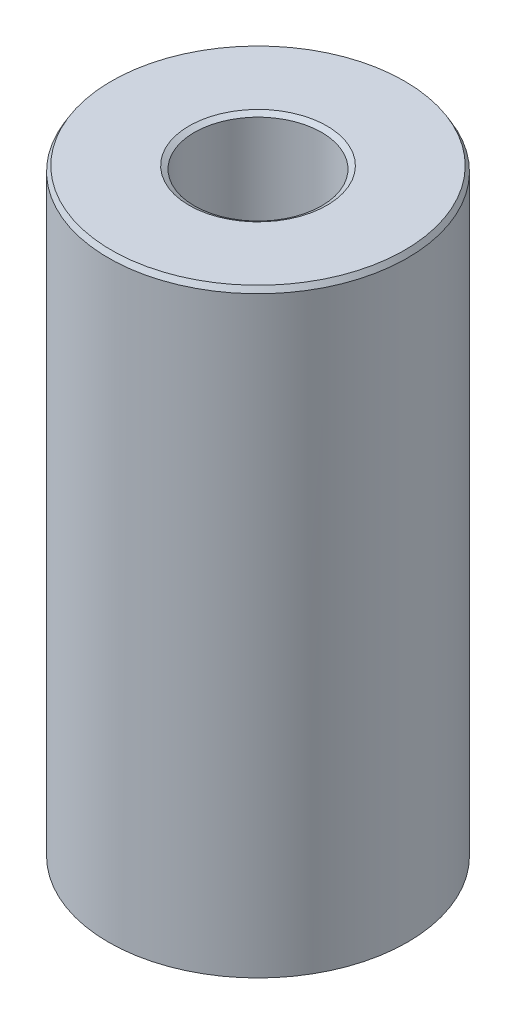
ISO-10303-21;
HEADER;
FILE_DESCRIPTION(('STEP AP214'),'2;1');
FILE_NAME('part.step','',(''),(''),'','','');
FILE_SCHEMA(('AUTOMOTIVE_DESIGN { 1 0 10303 214 1 1 1 1 }'));
ENDSEC;
DATA;
#1=APPLICATION_CONTEXT('core data for automotive mechanical design processes');
#2=APPLICATION_PROTOCOL_DEFINITION('international standard','automotive_design',2000,#1);
#3=PRODUCT_CONTEXT('',#1,'mechanical');
#4=PRODUCT('Part','Part','',(#3));
#5=PRODUCT_RELATED_PRODUCT_CATEGORY('part','',(#4));
#6=PRODUCT_DEFINITION_FORMATION('','',#4);
#7=PRODUCT_DEFINITION_CONTEXT('part definition',#1,'design');
#8=PRODUCT_DEFINITION('design','',#6,#7);
#9=PRODUCT_DEFINITION_SHAPE('','',#8);
#10=(LENGTH_UNIT() NAMED_UNIT(*) SI_UNIT(.MILLI.,.METRE.));
#11=(NAMED_UNIT(*) PLANE_ANGLE_UNIT() SI_UNIT($,.RADIAN.));
#12=(NAMED_UNIT(*) SI_UNIT($,.STERADIAN.) SOLID_ANGLE_UNIT());
#13=UNCERTAINTY_MEASURE_WITH_UNIT(LENGTH_MEASURE(1.E-05),#10,'distance_accuracy_value','');
#14=(GEOMETRIC_REPRESENTATION_CONTEXT(3) GLOBAL_UNCERTAINTY_ASSIGNED_CONTEXT((#13)) GLOBAL_UNIT_ASSIGNED_CONTEXT((#10,
#11,#12)) REPRESENTATION_CONTEXT('',''));
#15=CARTESIAN_POINT('',(0.,0.,0.));
#16=DIRECTION('',(0.,0.,1.));
#17=DIRECTION('',(1.,0.,0.));
#18=AXIS2_PLACEMENT_3D('',#15,#16,#17);
#19=CARTESIAN_POINT('',(0.,150.655996117848,0.));
#20=DIRECTION('',(0.,-1.,0.));
#21=DIRECTION('',(0.,0.,-1.));
#22=AXIS2_PLACEMENT_3D('',#19,#20,#21);
#23=CYLINDRICAL_SURFACE('',#22,37.5);
#24=CARTESIAN_POINT('',(0.,0.755875832907121,0.));
#25=DIRECTION('',(0.,1.,0.));
#26=DIRECTION('',(0.,0.,1.));
#27=AXIS2_PLACEMENT_3D('',#24,#25,#26);
#28=CIRCLE('',#27,37.5);
#29=CARTESIAN_POINT('',(0.,0.755875832907121,37.5));
#30=VERTEX_POINT('',#29);
#31=EDGE_CURVE('E10',#30,#30,#28,.T.);
#32=ORIENTED_EDGE('',*,*,#31,.T.);
#33=EDGE_LOOP('',(#32));
#34=FACE_BOUND('',#33,.T.);
#35=CARTESIAN_POINT('',(0.,149.346780771039,0.));
#36=DIRECTION('',(0.,1.,0.));
#37=DIRECTION('',(0.,0.,1.));
#38=AXIS2_PLACEMENT_3D('',#35,#36,#37);
#39=CIRCLE('',#38,37.5);
#40=CARTESIAN_POINT('',(0.,149.346780771039,-37.5));
#41=VERTEX_POINT('',#40);
#42=EDGE_CURVE('E50',#41,#41,#39,.F.);
#43=ORIENTED_EDGE('',*,*,#42,.T.);
#44=EDGE_LOOP('',(#43));
#45=FACE_BOUND('',#44,.T.);
#46=ADVANCED_FACE('F39',(#34,#45),#23,.T.);
#47=CARTESIAN_POINT('',(0.,150.655996117848,0.));
#48=DIRECTION('',(0.,1.,0.));
#49=DIRECTION('',(0.,0.,1.));
#50=AXIS2_PLACEMENT_3D('',#47,#48,#49);
#51=PLANE('',#50);
#52=CARTESIAN_POINT('',(0.,150.655996117848,0.));
#53=DIRECTION('',(0.,1.,0.));
#54=DIRECTION('',(0.,0.,1.));
#55=AXIS2_PLACEMENT_3D('',#52,#53,#54);
#56=CIRCLE('',#55,17.273251766127);
#57=CARTESIAN_POINT('',(0.,150.655996117848,17.273251766127));
#58=VERTEX_POINT('',#57);
#59=EDGE_CURVE('E58',#58,#58,#56,.F.);
#60=ORIENTED_EDGE('',*,*,#59,.T.);
#61=EDGE_LOOP('',(#60));
#62=FACE_BOUND('',#61,.T.);
#63=CARTESIAN_POINT('',(0.,150.655996117848,0.));
#64=DIRECTION('',(0.,1.,0.));
#65=DIRECTION('',(0.,0.,1.));
#66=AXIS2_PLACEMENT_3D('',#63,#64,#65);
#67=CIRCLE('',#66,36.7441241670929);
#68=CARTESIAN_POINT('',(0.,150.655996117848,-36.7441241670929));
#69=VERTEX_POINT('',#68);
#70=EDGE_CURVE('E61',#69,#69,#67,.T.);
#71=ORIENTED_EDGE('',*,*,#70,.T.);
#72=EDGE_LOOP('',(#71));
#73=FACE_BOUND('',#72,.T.);
#74=ADVANCED_FACE('F88',(#62,#73),#51,.T.);
#75=CARTESIAN_POINT('',(0.,0.,0.));
#76=DIRECTION('',(0.,1.,0.));
#77=DIRECTION('',(0.,0.,1.));
#78=AXIS2_PLACEMENT_3D('',#75,#76,#77);
#79=PLANE('',#78);
#80=CARTESIAN_POINT('',(0.,0.,0.));
#81=DIRECTION('',(0.,1.,0.));
#82=DIRECTION('',(0.,0.,1.));
#83=AXIS2_PLACEMENT_3D('',#80,#81,#82);
#84=CIRCLE('',#83,16.7199122522255);
#85=CARTESIAN_POINT('',(0.,0.,-16.7199122522255));
#86=VERTEX_POINT('',#85);
#87=EDGE_CURVE('E51',#86,#86,#84,.T.);
#88=ORIENTED_EDGE('',*,*,#87,.T.);
#89=EDGE_LOOP('',(#88));
#90=FACE_BOUND('',#89,.T.);
#91=CARTESIAN_POINT('',(0.,0.,0.));
#92=DIRECTION('',(0.,1.,0.));
#93=DIRECTION('',(0.,0.,1.));
#94=AXIS2_PLACEMENT_3D('',#91,#92,#93);
#95=CIRCLE('',#94,36.1907846531915);
#96=CARTESIAN_POINT('',(0.,0.,36.1907846531915));
#97=VERTEX_POINT('',#96);
#98=EDGE_CURVE('E54',#97,#97,#95,.F.);
#99=ORIENTED_EDGE('',*,*,#98,.T.);
#100=EDGE_LOOP('',(#99));
#101=FACE_BOUND('',#100,.T.);
#102=ADVANCED_FACE('F83',(#90,#101),#79,.F.);
#103=CARTESIAN_POINT('',(0.,150.655996117848,0.));
#104=DIRECTION('',(0.,-1.,0.));
#105=DIRECTION('',(0.,0.,-1.));
#106=AXIS2_PLACEMENT_3D('',#103,#104,#105);
#107=CYLINDRICAL_SURFACE('',#106,15.9640364193184);
#108=CARTESIAN_POINT('',(0.,149.900120284941,0.));
#109=DIRECTION('',(0.,1.,0.));
#110=DIRECTION('',(0.,0.,1.));
#111=AXIS2_PLACEMENT_3D('',#108,#109,#110);
#112=CIRCLE('',#111,15.9640364193184);
#113=CARTESIAN_POINT('',(0.,149.900120284941,15.9640364193184));
#114=VERTEX_POINT('',#113);
#115=EDGE_CURVE('E67',#114,#114,#112,.T.);
#116=ORIENTED_EDGE('',*,*,#115,.T.);
#117=EDGE_LOOP('',(#116));
#118=FACE_BOUND('',#117,.T.);
#119=CARTESIAN_POINT('',(0.,1.30921534680858,0.));
#120=DIRECTION('',(0.,1.,0.));
#121=DIRECTION('',(0.,0.,1.));
#122=AXIS2_PLACEMENT_3D('',#119,#120,#121);
#123=CIRCLE('',#122,15.9640364193184);
#124=CARTESIAN_POINT('',(0.,1.30921534680858,-15.9640364193184));
#125=VERTEX_POINT('',#124);
#126=EDGE_CURVE('E69',#125,#125,#123,.F.);
#127=ORIENTED_EDGE('',*,*,#126,.T.);
#128=EDGE_LOOP('',(#127));
#129=FACE_BOUND('',#128,.T.);
#130=ADVANCED_FACE('F71',(#118,#129),#107,.F.);
#131=CARTESIAN_POINT('',(0.,149.900120284941,0.));
#132=DIRECTION('',(0.,1.,0.));
#133=DIRECTION('',(0.,0.,1.));
#134=AXIS2_PLACEMENT_3D('',#131,#132,#133);
#135=CONICAL_SURFACE('',#134,15.9640364193184,1.04719755119659);
#136=ORIENTED_EDGE('',*,*,#59,.F.);
#137=EDGE_LOOP('',(#136));
#138=FACE_BOUND('',#137,.T.);
#139=ORIENTED_EDGE('',*,*,#115,.F.);
#140=EDGE_LOOP('',(#139));
#141=FACE_BOUND('',#140,.T.);
#142=ADVANCED_FACE('F77',(#138,#141),#135,.F.);
#143=CARTESIAN_POINT('',(0.,0.,0.));
#144=DIRECTION('',(0.,-1.,0.));
#145=DIRECTION('',(0.,0.,-1.));
#146=AXIS2_PLACEMENT_3D('',#143,#144,#145);
#147=CONICAL_SURFACE('',#146,16.7199122522255,0.523598775598301);
#148=CARTESIAN_POINT('',(0.,1.30921534680858,-15.9640364193184));
#149=CARTESIAN_POINT('',(0.,1.29557768694599,-15.9719101259112));
#150=CARTESIAN_POINT('',(0.,1.2819400270834,-15.979783832504));
#151=CARTESIAN_POINT('',(0.,1.25466470735823,-15.9955312456895));
#152=CARTESIAN_POINT('',(0.,1.24102704749564,-16.0034049522823));
#153=CARTESIAN_POINT('',(0.,1.21375172777046,-16.0191523654679));
#154=CARTESIAN_POINT('',(0.,1.20011406790787,-16.0270260720607));
#155=CARTESIAN_POINT('',(0.,1.17283874818269,-16.0427734852462));
#156=CARTESIAN_POINT('',(0.,1.1592010883201,-16.050647191839));
#157=CARTESIAN_POINT('',(0.,1.13192576859492,-16.0663946050246));
#158=CARTESIAN_POINT('',(0.,1.11828810873233,-16.0742683116173));
#159=CARTESIAN_POINT('',(0.,1.09101278900715,-16.0900157248029));
#160=CARTESIAN_POINT('',(0.,1.07737512914456,-16.0978894313957));
#161=CARTESIAN_POINT('',(0.,1.05009980941939,-16.1136368445813));
#162=CARTESIAN_POINT('',(0.,1.0364621495568,-16.121510551174));
#163=CARTESIAN_POINT('',(0.,1.00918682983162,-16.1372579643596));
#164=CARTESIAN_POINT('',(0.,0.995549169969027,-16.1451316709524));
#165=CARTESIAN_POINT('',(0.,0.968273850243848,-16.160879084138));
#166=CARTESIAN_POINT('',(0.,0.954636190381259,-16.1687527907307));
#167=CARTESIAN_POINT('',(0.,0.927360870656081,-16.1845002039163));
#168=CARTESIAN_POINT('',(0.,0.913723210793491,-16.1923739105091));
#169=CARTESIAN_POINT('',(0.,0.886447891068312,-16.2081213236947));
#170=CARTESIAN_POINT('',(0.,0.872810231205723,-16.2159950302874));
#171=CARTESIAN_POINT('',(0.,0.845534911480544,-16.231742443473));
#172=CARTESIAN_POINT('',(0.,0.831897251617954,-16.2396161500658));
#173=CARTESIAN_POINT('',(0.,0.804621931892776,-16.2553635632514));
#174=CARTESIAN_POINT('',(0.,0.790984272030187,-16.2632372698441));
#175=CARTESIAN_POINT('',(0.,0.763708952305008,-16.2789846830297));
#176=CARTESIAN_POINT('',(0.,0.750071292442418,-16.2868583896225));
#177=CARTESIAN_POINT('',(0.,0.722795972717239,-16.302605802808));
#178=CARTESIAN_POINT('',(0.,0.70915831285465,-16.3104795094008));
#179=CARTESIAN_POINT('',(0.,0.681882993129471,-16.3262269225864));
#180=CARTESIAN_POINT('',(0.,0.668245333266882,-16.3341006291792));
#181=CARTESIAN_POINT('',(0.,0.640970013541703,-16.3498480423647));
#182=CARTESIAN_POINT('',(0.,0.627332353679113,-16.3577217489575));
#183=CARTESIAN_POINT('',(0.,0.600057033953935,-16.3734691621431));
#184=CARTESIAN_POINT('',(0.,0.586419374091345,-16.3813428687359));
#185=CARTESIAN_POINT('',(0.,0.559144054366166,-16.3970902819214));
#186=CARTESIAN_POINT('',(0.,0.545506394503577,-16.4049639885142));
#187=CARTESIAN_POINT('',(0.,0.518231074778397,-16.4207114016998));
#188=CARTESIAN_POINT('',(0.,0.504593414915808,-16.4285851082926));
#189=CARTESIAN_POINT('',(0.,0.47731809519063,-16.4443325214781));
#190=CARTESIAN_POINT('',(0.,0.46368043532804,-16.4522062280709));
#191=CARTESIAN_POINT('',(0.,0.436405115602861,-16.4679536412565));
#192=CARTESIAN_POINT('',(0.,0.422767455740272,-16.4758273478493));
#193=CARTESIAN_POINT('',(0.,0.395492136015093,-16.4915747610348));
#194=CARTESIAN_POINT('',(0.,0.381854476152504,-16.4994484676276));
#195=CARTESIAN_POINT('',(0.,0.354579156427325,-16.5151958808132));
#196=CARTESIAN_POINT('',(0.,0.340941496564736,-16.523069587406));
#197=CARTESIAN_POINT('',(0.,0.313666176839557,-16.5388170005915));
#198=CARTESIAN_POINT('',(0.,0.300028516976967,-16.5466907071843));
#199=CARTESIAN_POINT('',(0.,0.272753197251788,-16.5624381203699));
#200=CARTESIAN_POINT('',(0.,0.259115537389199,-16.5703118269627));
#201=CARTESIAN_POINT('',(0.,0.23184021766402,-16.5860592401482));
#202=CARTESIAN_POINT('',(0.,0.218202557801431,-16.593932946741));
#203=CARTESIAN_POINT('',(0.,0.190927238076252,-16.6096803599266));
#204=CARTESIAN_POINT('',(0.,0.177289578213662,-16.6175540665194));
#205=CARTESIAN_POINT('',(0.,0.150014258488484,-16.6333014797049));
#206=CARTESIAN_POINT('',(0.,0.136376598625894,-16.6411751862977));
#207=CARTESIAN_POINT('',(0.,0.109101278900716,-16.6569225994833));
#208=CARTESIAN_POINT('',(0.,0.0954636190381258,-16.664796306076));
#209=CARTESIAN_POINT('',(0.,0.0681882993129468,-16.6805437192616));
#210=CARTESIAN_POINT('',(0.,0.0545506394503575,-16.6884174258544));
#211=CARTESIAN_POINT('',(0.,0.027275319725179,-16.70416483904));
#212=CARTESIAN_POINT('',(0.,0.0136376598625898,-16.7120385456327));
#213=CARTESIAN_POINT('',(0.,0.,-16.7199122522255));
#214=B_SPLINE_CURVE_WITH_KNOTS('',3,(#148,#149,#150,#151,#152,#153,#154,#155,#156,#157,#158,
#159,#160,#161,#162,#163,#164,#165,#166,#167,#168,#169,#170,#171,#172,#173,#174,#175,#176,#177,
#178,#179,#180,#181,#182,#183,#184,#185,#186,#187,#188,#189,#190,#191,#192,#193,#194,#195,#196,
#197,#198,#199,#200,#201,#202,#203,#204,#205,#206,#207,#208,#209,#210,#211,#212,#213),
.UNSPECIFIED.,.F.,.F.,(4,2,2,2,2,2,2,2,2,2,2,2,2,2,2,2,2,2,2,2,2,2,2,2,2,2,2,2,2,2,2,2,4),(0.,
0.0472422395566957,0.0944844791133914,0.141726718670085,0.188968958226781,0.236211197783477,
0.283453437340173,0.330695676896868,0.377937916453562,0.425180156010258,0.472422395566954,
0.519664635123649,0.566906874680345,0.614149114237041,0.661391353793735,0.708633593350431,
0.755875832907126,0.803118072463822,0.850360312020518,0.897602551577212,0.944844791133907,
0.992087030690603,1.0393292702473,1.08657150980399,1.13381374936069,1.18105598891738,
1.22829822847408,1.27554046803078,1.32278270758747,1.37002494714417,1.41726718670086,
1.46450942625756,1.51175166581425),.UNSPECIFIED.);
#215=EDGE_CURVE('BSEAM73',#125,#86,#214,.T.);
#216=ORIENTED_EDGE('',*,*,#126,.F.);
#217=ORIENTED_EDGE('',*,*,#87,.F.);
#218=ORIENTED_EDGE('',*,*,#215,.T.);
#219=ORIENTED_EDGE('',*,*,#215,.F.);
#220=EDGE_LOOP('',(#216,#218,#217,#219));
#221=FACE_BOUND('',#220,.T.);
#222=ADVANCED_FACE('F73',(#221),#147,.F.);
#223=CARTESIAN_POINT('',(0.,0.755875832907121,0.));
#224=DIRECTION('',(0.,1.,0.));
#225=DIRECTION('',(0.,0.,1.));
#226=AXIS2_PLACEMENT_3D('',#223,#224,#225);
#227=CONICAL_SURFACE('',#226,37.5,1.04719755119659);
#228=ORIENTED_EDGE('',*,*,#98,.F.);
#229=EDGE_LOOP('',(#228));
#230=FACE_BOUND('',#229,.T.);
#231=ORIENTED_EDGE('',*,*,#31,.F.);
#232=EDGE_LOOP('',(#231));
#233=FACE_BOUND('',#232,.T.);
#234=ADVANCED_FACE('F76',(#230,#233),#227,.T.);
#235=CARTESIAN_POINT('',(0.,150.655996117848,0.));
#236=DIRECTION('',(0.,-1.,0.));
#237=DIRECTION('',(0.,0.,-1.));
#238=AXIS2_PLACEMENT_3D('',#235,#236,#237);
#239=CONICAL_SURFACE('',#238,36.7441241670929,0.523598775598281);
#240=CARTESIAN_POINT('',(0.,149.346780771039,-37.5));
#241=CARTESIAN_POINT('',(0.,149.360418430902,-37.4921262934072));
#242=CARTESIAN_POINT('',(0.,149.374056090764,-37.4842525868144));
#243=CARTESIAN_POINT('',(0.,149.401331410489,-37.4685051736289));
#244=CARTESIAN_POINT('',(0.,149.414969070352,-37.4606314670361));
#245=CARTESIAN_POINT('',(0.,149.442244390077,-37.4448840538505));
#246=CARTESIAN_POINT('',(0.,149.45588204994,-37.4370103472578));
#247=CARTESIAN_POINT('',(0.,149.483157369665,-37.4212629340722));
#248=CARTESIAN_POINT('',(0.,149.496795029528,-37.4133892274794));
#249=CARTESIAN_POINT('',(0.,149.524070349253,-37.3976418142938));
#250=CARTESIAN_POINT('',(0.,149.537708009115,-37.3897681077011));
#251=CARTESIAN_POINT('',(0.,149.564983328841,-37.3740206945155));
#252=CARTESIAN_POINT('',(0.,149.578620988703,-37.3661469879227));
#253=CARTESIAN_POINT('',(0.,149.605896308428,-37.3503995747372));
#254=CARTESIAN_POINT('',(0.,149.619533968291,-37.3425258681444));
#255=CARTESIAN_POINT('',(0.,149.646809288016,-37.3267784549588));
#256=CARTESIAN_POINT('',(0.,149.660446947879,-37.318904748366));
#257=CARTESIAN_POINT('',(0.,149.687722267604,-37.3031573351805));
#258=CARTESIAN_POINT('',(0.,149.701359927466,-37.2952836285877));
#259=CARTESIAN_POINT('',(0.,149.728635247192,-37.2795362154021));
#260=CARTESIAN_POINT('',(0.,149.742272907054,-37.2716625088093));
#261=CARTESIAN_POINT('',(0.,149.769548226779,-37.2559150956238));
#262=CARTESIAN_POINT('',(0.,149.783185886642,-37.248041389031));
#263=CARTESIAN_POINT('',(0.,149.810461206367,-37.2322939758454));
#264=CARTESIAN_POINT('',(0.,149.82409886623,-37.2244202692526));
#265=CARTESIAN_POINT('',(0.,149.851374185955,-37.2086728560671));
#266=CARTESIAN_POINT('',(0.,149.865011845818,-37.2007991494743));
#267=CARTESIAN_POINT('',(0.,149.892287165543,-37.1850517362887));
#268=CARTESIAN_POINT('',(0.,149.905924825405,-37.1771780296959));
#269=CARTESIAN_POINT('',(0.,149.93320014513,-37.1614306165104));
#270=CARTESIAN_POINT('',(0.,149.946837804993,-37.1535569099176));
#271=CARTESIAN_POINT('',(0.,149.974113124718,-37.137809496732));
#272=CARTESIAN_POINT('',(0.,149.987750784581,-37.1299357901392));
#273=CARTESIAN_POINT('',(0.,150.015026104306,-37.1141883769537));
#274=CARTESIAN_POINT('',(0.,150.028663764169,-37.1063146703609));
#275=CARTESIAN_POINT('',(0.,150.055939083894,-37.0905672571753));
#276=CARTESIAN_POINT('',(0.,150.069576743756,-37.0826935505826));
#277=CARTESIAN_POINT('',(0.,150.096852063482,-37.066946137397));
#278=CARTESIAN_POINT('',(0.,150.110489723344,-37.0590724308042));
#279=CARTESIAN_POINT('',(0.,150.137765043069,-37.0433250176186));
#280=CARTESIAN_POINT('',(0.,150.151402702932,-37.0354513110259));
#281=CARTESIAN_POINT('',(0.,150.178678022657,-37.0197038978403));
#282=CARTESIAN_POINT('',(0.,150.19231568252,-37.0118301912475));
#283=CARTESIAN_POINT('',(0.,150.219591002245,-36.9960827780619));
#284=CARTESIAN_POINT('',(0.,150.233228662107,-36.9882090714692));
#285=CARTESIAN_POINT('',(0.,150.260503981833,-36.9724616582836));
#286=CARTESIAN_POINT('',(0.,150.274141641695,-36.9645879516908));
#287=CARTESIAN_POINT('',(0.,150.30141696142,-36.9488405385053));
#288=CARTESIAN_POINT('',(0.,150.315054621283,-36.9409668319125));
#289=CARTESIAN_POINT('',(0.,150.342329941008,-36.9252194187269));
#290=CARTESIAN_POINT('',(0.,150.355967600871,-36.9173457121341));
#291=CARTESIAN_POINT('',(0.,150.383242920596,-36.9015982989486));
#292=CARTESIAN_POINT('',(0.,150.396880580458,-36.8937245923558));
#293=CARTESIAN_POINT('',(0.,150.424155900184,-36.8779771791702));
#294=CARTESIAN_POINT('',(0.,150.437793560046,-36.8701034725774));
#295=CARTESIAN_POINT('',(0.,150.465068879771,-36.8543560593919));
#296=CARTESIAN_POINT('',(0.,150.478706539634,-36.8464823527991));
#297=CARTESIAN_POINT('',(0.,150.505981859359,-36.8307349396135));
#298=CARTESIAN_POINT('',(0.,150.519619519222,-36.8228612330207));
#299=CARTESIAN_POINT('',(0.,150.546894838947,-36.8071138198352));
#300=CARTESIAN_POINT('',(0.,150.56053249881,-36.7992401132424));
#301=CARTESIAN_POINT('',(0.,150.587807818535,-36.7834927000568));
#302=CARTESIAN_POINT('',(0.,150.601445478397,-36.7756189934641));
#303=CARTESIAN_POINT('',(0.,150.628720798123,-36.7598715802785));
#304=CARTESIAN_POINT('',(0.,150.642358457985,-36.7519978736857));
#305=CARTESIAN_POINT('',(0.,150.655996117848,-36.7441241670929));
#306=B_SPLINE_CURVE_WITH_KNOTS('',3,(#240,#241,#242,#243,#244,#245,#246,#247,#248,#249,#250,
#251,#252,#253,#254,#255,#256,#257,#258,#259,#260,#261,#262,#263,#264,#265,#266,#267,#268,#269,
#270,#271,#272,#273,#274,#275,#276,#277,#278,#279,#280,#281,#282,#283,#284,#285,#286,#287,#288,
#289,#290,#291,#292,#293,#294,#295,#296,#297,#298,#299,#300,#301,#302,#303,#304,#305),
.UNSPECIFIED.,.F.,.F.,(4,2,2,2,2,2,2,2,2,2,2,2,2,2,2,2,2,2,2,2,2,2,2,2,2,2,2,2,2,2,2,2,4),(0.,
0.0472422395567025,0.0944844791134015,0.141726718670104,0.188968958226782,0.236211197783485,
0.283453437340184,0.330695676896886,0.377937916453565,0.425180156010267,0.472422395566966,
0.519664635123644,0.566906874680347,0.614149114237049,0.661391353793748,0.708633593350427,
0.755875832907129,0.803118072463832,0.850360312020507,0.897602551577209,0.944844791133912,
0.992087030690614,1.03932927024729,1.08657150980399,1.13381374936069,1.18105598891737,
1.22829822847407,1.27554046803077,1.32278270758748,1.37002494714415,1.41726718670085,
1.46450942625756,1.51175166581426),.UNSPECIFIED.);
#307=EDGE_CURVE('BSEAM45',#41,#69,#306,.T.);
#308=ORIENTED_EDGE('',*,*,#42,.F.);
#309=ORIENTED_EDGE('',*,*,#70,.F.);
#310=ORIENTED_EDGE('',*,*,#307,.T.);
#311=ORIENTED_EDGE('',*,*,#307,.F.);
#312=EDGE_LOOP('',(#308,#310,#309,#311));
#313=FACE_BOUND('',#312,.T.);
#314=ADVANCED_FACE('F45',(#313),#239,.T.);
#315=CLOSED_SHELL('',(#46,#74,#102,#130,#142,#222,#234,#314));
#316=MANIFOLD_SOLID_BREP('B2',#315);
#317=ADVANCED_BREP_SHAPE_REPRESENTATION('',(#18,#316),#14);
#318=SHAPE_DEFINITION_REPRESENTATION(#9,#317);
ENDSEC;
END-ISO-10303-21;
